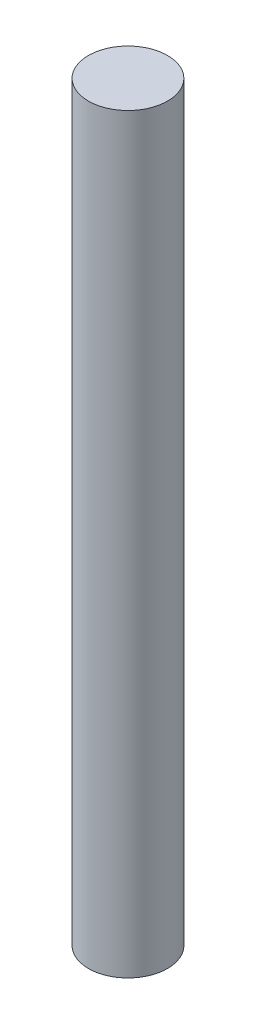
ISO-10303-21;
HEADER;
FILE_DESCRIPTION(('STEP AP214'),'2;1');
FILE_NAME('part.step','',(''),(''),'','','');
FILE_SCHEMA(('AUTOMOTIVE_DESIGN { 1 0 10303 214 1 1 1 1 }'));
ENDSEC;
DATA;
#1=APPLICATION_CONTEXT('core data for automotive mechanical design processes');
#2=APPLICATION_PROTOCOL_DEFINITION('international standard','automotive_design',2000,#1);
#3=PRODUCT_CONTEXT('',#1,'mechanical');
#4=PRODUCT('Part','Part','',(#3));
#5=PRODUCT_RELATED_PRODUCT_CATEGORY('part','',(#4));
#6=PRODUCT_DEFINITION_FORMATION('','',#4);
#7=PRODUCT_DEFINITION_CONTEXT('part definition',#1,'design');
#8=PRODUCT_DEFINITION('design','',#6,#7);
#9=PRODUCT_DEFINITION_SHAPE('','',#8);
#10=(LENGTH_UNIT() NAMED_UNIT(*) SI_UNIT(.MILLI.,.METRE.));
#11=(NAMED_UNIT(*) PLANE_ANGLE_UNIT() SI_UNIT($,.RADIAN.));
#12=(NAMED_UNIT(*) SI_UNIT($,.STERADIAN.) SOLID_ANGLE_UNIT());
#13=UNCERTAINTY_MEASURE_WITH_UNIT(LENGTH_MEASURE(1.E-05),#10,'distance_accuracy_value','');
#14=(GEOMETRIC_REPRESENTATION_CONTEXT(3) GLOBAL_UNCERTAINTY_ASSIGNED_CONTEXT((#13)) GLOBAL_UNIT_ASSIGNED_CONTEXT((#10,
#11,#12)) REPRESENTATION_CONTEXT('',''));
#15=CARTESIAN_POINT('',(0.,0.,0.));
#16=DIRECTION('',(0.,0.,1.));
#17=DIRECTION('',(1.,0.,0.));
#18=AXIS2_PLACEMENT_3D('',#15,#16,#17);
#19=CARTESIAN_POINT('',(0.,380.,0.));
#20=DIRECTION('',(0.,-1.,0.));
#21=DIRECTION('',(0.,0.,-1.));
#22=AXIS2_PLACEMENT_3D('',#19,#20,#21);
#23=CYLINDRICAL_SURFACE('',#22,20.);
#24=CARTESIAN_POINT('',(0.,380.,0.));
#25=DIRECTION('',(0.,1.,0.));
#26=DIRECTION('',(0.,0.,1.));
#27=AXIS2_PLACEMENT_3D('',#24,#25,#26);
#28=CIRCLE('',#27,20.);
#29=CARTESIAN_POINT('',(0.,380.,20.));
#30=VERTEX_POINT('',#29);
#31=EDGE_CURVE('E10',#30,#30,#28,.T.);
#32=ORIENTED_EDGE('',*,*,#31,.F.);
#33=EDGE_LOOP('',(#32));
#34=FACE_BOUND('',#33,.T.);
#35=CARTESIAN_POINT('',(0.,0.,0.));
#36=DIRECTION('',(0.,1.,0.));
#37=DIRECTION('',(0.,0.,1.));
#38=AXIS2_PLACEMENT_3D('',#35,#36,#37);
#39=CIRCLE('',#38,20.);
#40=CARTESIAN_POINT('',(0.,0.,20.));
#41=VERTEX_POINT('',#40);
#42=EDGE_CURVE('E39',#41,#41,#39,.T.);
#43=ORIENTED_EDGE('',*,*,#42,.T.);
#44=EDGE_LOOP('',(#43));
#45=FACE_BOUND('',#44,.T.);
#46=ADVANCED_FACE('F36',(#34,#45),#23,.T.);
#47=CARTESIAN_POINT('',(0.,380.,0.));
#48=DIRECTION('',(0.,1.,0.));
#49=DIRECTION('',(0.,0.,1.));
#50=AXIS2_PLACEMENT_3D('',#47,#48,#49);
#51=PLANE('',#50);
#52=ORIENTED_EDGE('',*,*,#31,.T.);
#53=EDGE_LOOP('',(#52));
#54=FACE_BOUND('',#53,.T.);
#55=ADVANCED_FACE('F51',(#54),#51,.T.);
#56=CARTESIAN_POINT('',(0.,0.,0.));
#57=DIRECTION('',(0.,1.,0.));
#58=DIRECTION('',(0.,0.,1.));
#59=AXIS2_PLACEMENT_3D('',#56,#57,#58);
#60=PLANE('',#59);
#61=ORIENTED_EDGE('',*,*,#42,.F.);
#62=EDGE_LOOP('',(#61));
#63=FACE_BOUND('',#62,.T.);
#64=ADVANCED_FACE('F49',(#63),#60,.F.);
#65=CLOSED_SHELL('',(#46,#55,#64));
#66=MANIFOLD_SOLID_BREP('B2',#65);
#67=ADVANCED_BREP_SHAPE_REPRESENTATION('',(#18,#66),#14);
#68=SHAPE_DEFINITION_REPRESENTATION(#9,#67);
ENDSEC;
END-ISO-10303-21;
